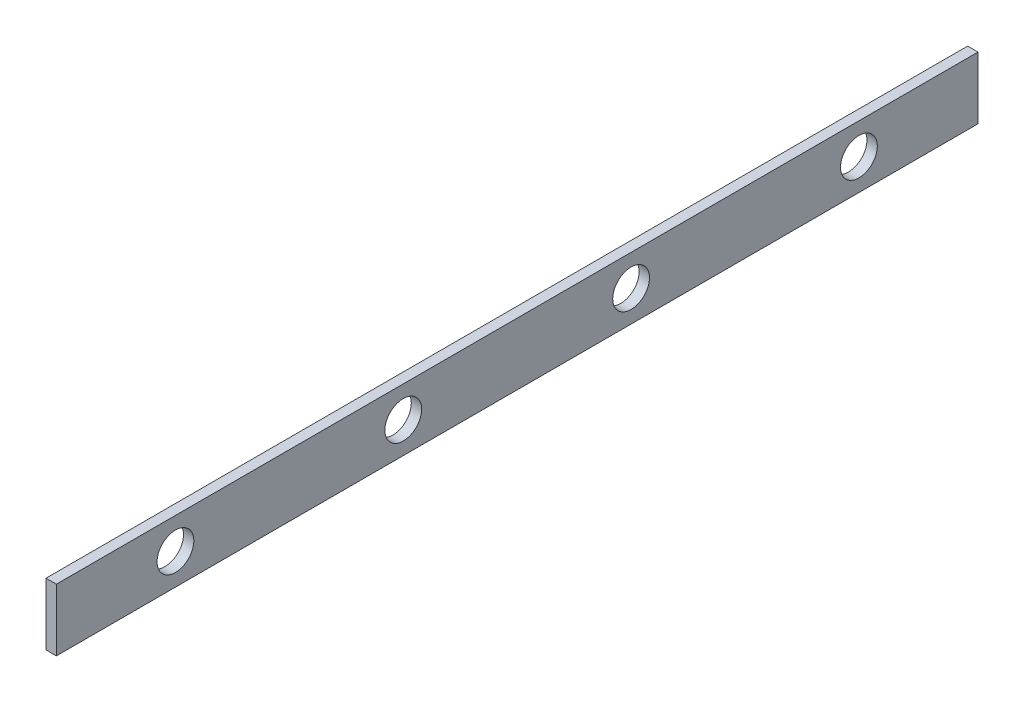
ISO-10303-21;
HEADER;
FILE_DESCRIPTION(('STEP AP214'),'2;1');
FILE_NAME('part.step','',(''),(''),'','','');
FILE_SCHEMA(('AUTOMOTIVE_DESIGN { 1 0 10303 214 1 1 1 1 }'));
ENDSEC;
DATA;
#1=APPLICATION_CONTEXT('core data for automotive mechanical design processes');
#2=APPLICATION_PROTOCOL_DEFINITION('international standard','automotive_design',2000,#1);
#3=PRODUCT_CONTEXT('',#1,'mechanical');
#4=PRODUCT('Part','Part','',(#3));
#5=PRODUCT_RELATED_PRODUCT_CATEGORY('part','',(#4));
#6=PRODUCT_DEFINITION_FORMATION('','',#4);
#7=PRODUCT_DEFINITION_CONTEXT('part definition',#1,'design');
#8=PRODUCT_DEFINITION('design','',#6,#7);
#9=PRODUCT_DEFINITION_SHAPE('','',#8);
#10=(LENGTH_UNIT() NAMED_UNIT(*) SI_UNIT(.MILLI.,.METRE.));
#11=(NAMED_UNIT(*) PLANE_ANGLE_UNIT() SI_UNIT($,.RADIAN.));
#12=(NAMED_UNIT(*) SI_UNIT($,.STERADIAN.) SOLID_ANGLE_UNIT());
#13=UNCERTAINTY_MEASURE_WITH_UNIT(LENGTH_MEASURE(1.E-05),#10,'distance_accuracy_value','');
#14=(GEOMETRIC_REPRESENTATION_CONTEXT(3) GLOBAL_UNCERTAINTY_ASSIGNED_CONTEXT((#13)) GLOBAL_UNIT_ASSIGNED_CONTEXT((#10,
#11,#12)) REPRESENTATION_CONTEXT('',''));
#15=CARTESIAN_POINT('',(0.,0.,0.));
#16=DIRECTION('',(0.,0.,1.));
#17=DIRECTION('',(1.,0.,0.));
#18=AXIS2_PLACEMENT_3D('',#15,#16,#17);
#19=CARTESIAN_POINT('',(600.,-60.0000000000011,-445.));
#20=DIRECTION('',(0.,0.999999999999999,0.));
#21=DIRECTION('',(0.,0.,0.999999999999999));
#22=AXIS2_PLACEMENT_3D('',#19,#20,#21);
#23=PLANE('',#22);
#24=DIRECTION('',(-1.,0.,0.));
#25=VECTOR('',#24,1.);
#26=CARTESIAN_POINT('',(600.000000000001,-60.0000000000008,445.));
#27=LINE('',#26,#25);
#28=CARTESIAN_POINT('',(610.000000000001,-60.0000000000009,445.));
#29=VERTEX_POINT('',#28);
#30=CARTESIAN_POINT('',(600.000000000001,-60.0000000000008,445.));
#31=VERTEX_POINT('',#30);
#32=EDGE_CURVE('E109',#29,#31,#27,.T.);
#33=ORIENTED_EDGE('',*,*,#32,.T.);
#34=DIRECTION('',(0.,0.,0.999999999999999));
#35=VECTOR('',#34,1.);
#36=CARTESIAN_POINT('',(600.,-60.0000000000011,-445.));
#37=LINE('',#36,#35);
#38=CARTESIAN_POINT('',(600.,-60.0000000000011,-445.));
#39=VERTEX_POINT('',#38);
#40=EDGE_CURVE('E11',#39,#31,#37,.T.);
#41=ORIENTED_EDGE('',*,*,#40,.F.);
#42=DIRECTION('',(-1.,0.,0.));
#43=VECTOR('',#42,1.);
#44=CARTESIAN_POINT('',(600.,-60.0000000000011,-445.));
#45=LINE('',#44,#43);
#46=CARTESIAN_POINT('',(610.000000000001,-60.0000000000011,-445.));
#47=VERTEX_POINT('',#46);
#48=EDGE_CURVE('E92',#47,#39,#45,.T.);
#49=ORIENTED_EDGE('',*,*,#48,.F.);
#50=DIRECTION('',(0.,0.,0.999999999999999));
#51=VECTOR('',#50,1.);
#52=CARTESIAN_POINT('',(610.000000000001,-60.0000000000011,-445.));
#53=LINE('',#52,#51);
#54=EDGE_CURVE('E105',#47,#29,#53,.T.);
#55=ORIENTED_EDGE('',*,*,#54,.T.);
#56=EDGE_LOOP('',(#33,#41,#49,#55));
#57=FACE_BOUND('',#56,.T.);
#58=ADVANCED_FACE('F40',(#57),#23,.F.);
#59=CARTESIAN_POINT('',(600.,-60.0000000000011,-445.));
#60=DIRECTION('',(1.,0.,0.));
#61=DIRECTION('',(0.,0.,-0.999999999999999));
#62=AXIS2_PLACEMENT_3D('',#59,#60,#61);
#63=PLANE('',#62);
#64=CARTESIAN_POINT('',(600.,-30.000000000014,329.999999999999));
#65=DIRECTION('',(1.,0.,0.));
#66=DIRECTION('',(0.,0.,-0.999999999999999));
#67=AXIS2_PLACEMENT_3D('',#64,#65,#66);
#68=CIRCLE('',#67,17.75);
#69=CARTESIAN_POINT('',(600.,-30.000000000014,312.249999999999));
#70=VERTEX_POINT('',#69);
#71=EDGE_CURVE('E155',#70,#70,#68,.T.);
#72=ORIENTED_EDGE('',*,*,#71,.T.);
#73=EDGE_LOOP('',(#72));
#74=FACE_BOUND('',#73,.T.);
#75=CARTESIAN_POINT('',(600.,-30.0000000000147,109.999999999999));
#76=DIRECTION('',(1.,0.,0.));
#77=DIRECTION('',(0.,0.,-0.999999999999999));
#78=AXIS2_PLACEMENT_3D('',#75,#76,#77);
#79=CIRCLE('',#78,17.75);
#80=CARTESIAN_POINT('',(600.,-30.0000000000147,92.2499999999993));
#81=VERTEX_POINT('',#80);
#82=EDGE_CURVE('E147',#81,#81,#79,.T.);
#83=ORIENTED_EDGE('',*,*,#82,.T.);
#84=EDGE_LOOP('',(#83));
#85=FACE_BOUND('',#84,.T.);
#86=CARTESIAN_POINT('',(600.,-30.0000000000146,-110.000000000001));
#87=DIRECTION('',(1.,0.,0.));
#88=DIRECTION('',(0.,0.,-0.999999999999999));
#89=AXIS2_PLACEMENT_3D('',#86,#87,#88);
#90=CIRCLE('',#89,17.75);
#91=CARTESIAN_POINT('',(600.,-30.0000000000146,-127.750000000001));
#92=VERTEX_POINT('',#91);
#93=EDGE_CURVE('E139',#92,#92,#90,.T.);
#94=ORIENTED_EDGE('',*,*,#93,.T.);
#95=EDGE_LOOP('',(#94));
#96=FACE_BOUND('',#95,.T.);
#97=CARTESIAN_POINT('',(600.,-30.0000000000141,-330.000000000001));
#98=DIRECTION('',(1.,0.,0.));
#99=DIRECTION('',(0.,0.,-0.999999999999999));
#100=AXIS2_PLACEMENT_3D('',#97,#98,#99);
#101=CIRCLE('',#100,17.75);
#102=CARTESIAN_POINT('',(600.,-30.0000000000141,-347.750000000001));
#103=VERTEX_POINT('',#102);
#104=EDGE_CURVE('E113',#103,#103,#101,.T.);
#105=ORIENTED_EDGE('',*,*,#104,.T.);
#106=EDGE_LOOP('',(#105));
#107=FACE_BOUND('',#106,.T.);
#108=DIRECTION('',(0.,0.999999999999999,0.));
#109=VECTOR('',#108,1.);
#110=CARTESIAN_POINT('',(600.000000000001,-60.0000000000008,445.));
#111=LINE('',#110,#109);
#112=CARTESIAN_POINT('',(600.000000000001,-5.55111512312578E-13,445.));
#113=VERTEX_POINT('',#112);
#114=EDGE_CURVE('E97',#31,#113,#111,.T.);
#115=ORIENTED_EDGE('',*,*,#114,.T.);
#116=DIRECTION('',(0.,0.,0.999999999999999));
#117=VECTOR('',#116,1.);
#118=CARTESIAN_POINT('',(600.000000000001,0.,-445.));
#119=LINE('',#118,#117);
#120=CARTESIAN_POINT('',(600.000000000001,0.,-445.));
#121=VERTEX_POINT('',#120);
#122=EDGE_CURVE('E49',#121,#113,#119,.T.);
#123=ORIENTED_EDGE('',*,*,#122,.F.);
#124=DIRECTION('',(0.,0.999999999999999,0.));
#125=VECTOR('',#124,1.);
#126=CARTESIAN_POINT('',(600.,-60.0000000000011,-445.));
#127=LINE('',#126,#125);
#128=EDGE_CURVE('E87',#39,#121,#127,.T.);
#129=ORIENTED_EDGE('',*,*,#128,.F.);
#130=ORIENTED_EDGE('',*,*,#40,.T.);
#131=EDGE_LOOP('',(#115,#123,#129,#130));
#132=FACE_BOUND('',#131,.T.);
#133=ADVANCED_FACE('F96',(#74,#85,#96,#107,#132),#63,.F.);
#134=CARTESIAN_POINT('',(610.000000000001,0.,-445.));
#135=DIRECTION('',(0.,-0.999999999999999,0.));
#136=DIRECTION('',(0.,0.,-0.999999999999999));
#137=AXIS2_PLACEMENT_3D('',#134,#135,#136);
#138=PLANE('',#137);
#139=DIRECTION('',(1.,0.,0.));
#140=VECTOR('',#139,1.);
#141=CARTESIAN_POINT('',(610.000000000001,-6.66133814775094E-13,445.));
#142=LINE('',#141,#140);
#143=CARTESIAN_POINT('',(610.000000000001,-6.66133814775094E-13,445.));
#144=VERTEX_POINT('',#143);
#145=EDGE_CURVE('E74',#113,#144,#142,.T.);
#146=ORIENTED_EDGE('',*,*,#145,.T.);
#147=DIRECTION('',(0.,0.,0.999999999999999));
#148=VECTOR('',#147,1.);
#149=CARTESIAN_POINT('',(610.000000000001,0.,-445.));
#150=LINE('',#149,#148);
#151=CARTESIAN_POINT('',(610.000000000001,0.,-445.));
#152=VERTEX_POINT('',#151);
#153=EDGE_CURVE('E99',#152,#144,#150,.T.);
#154=ORIENTED_EDGE('',*,*,#153,.F.);
#155=DIRECTION('',(1.,0.,0.));
#156=VECTOR('',#155,1.);
#157=CARTESIAN_POINT('',(610.000000000001,0.,-445.));
#158=LINE('',#157,#156);
#159=EDGE_CURVE('E90',#121,#152,#158,.T.);
#160=ORIENTED_EDGE('',*,*,#159,.F.);
#161=ORIENTED_EDGE('',*,*,#122,.T.);
#162=EDGE_LOOP('',(#146,#154,#160,#161));
#163=FACE_BOUND('',#162,.T.);
#164=ADVANCED_FACE('F100',(#163),#138,.F.);
#165=CARTESIAN_POINT('',(610.000000000001,-60.0000000000011,-445.));
#166=DIRECTION('',(-1.,0.,0.));
#167=DIRECTION('',(0.,0.,0.999999999999999));
#168=AXIS2_PLACEMENT_3D('',#165,#166,#167);
#169=PLANE('',#168);
#170=CARTESIAN_POINT('',(610.,-30.000000000014,330.));
#171=DIRECTION('',(-1.,0.,0.));
#172=DIRECTION('',(0.,0.,1.));
#173=AXIS2_PLACEMENT_3D('',#170,#171,#172);
#174=CIRCLE('',#173,17.75);
#175=CARTESIAN_POINT('',(610.,-30.000000000014,347.75));
#176=VERTEX_POINT('',#175);
#177=EDGE_CURVE('E159',#176,#176,#174,.T.);
#178=ORIENTED_EDGE('',*,*,#177,.T.);
#179=EDGE_LOOP('',(#178));
#180=FACE_BOUND('',#179,.T.);
#181=CARTESIAN_POINT('',(610.000000000001,-30.0000000000147,109.999999999999));
#182=DIRECTION('',(-1.,0.,0.));
#183=DIRECTION('',(0.,0.,1.));
#184=AXIS2_PLACEMENT_3D('',#181,#182,#183);
#185=CIRCLE('',#184,17.75);
#186=CARTESIAN_POINT('',(610.000000000001,-30.0000000000147,127.749999999999));
#187=VERTEX_POINT('',#186);
#188=EDGE_CURVE('E151',#187,#187,#185,.T.);
#189=ORIENTED_EDGE('',*,*,#188,.T.);
#190=EDGE_LOOP('',(#189));
#191=FACE_BOUND('',#190,.T.);
#192=CARTESIAN_POINT('',(610.,-30.0000000000146,-110.000000000001));
#193=DIRECTION('',(-1.,0.,0.));
#194=DIRECTION('',(0.,0.,1.));
#195=AXIS2_PLACEMENT_3D('',#192,#193,#194);
#196=CIRCLE('',#195,17.75);
#197=CARTESIAN_POINT('',(610.,-30.0000000000146,-92.2500000000007));
#198=VERTEX_POINT('',#197);
#199=EDGE_CURVE('E143',#198,#198,#196,.T.);
#200=ORIENTED_EDGE('',*,*,#199,.T.);
#201=EDGE_LOOP('',(#200));
#202=FACE_BOUND('',#201,.T.);
#203=CARTESIAN_POINT('',(610.,-30.0000000000146,-330.000000000001));
#204=DIRECTION('',(-1.,0.,0.));
#205=DIRECTION('',(0.,0.,1.));
#206=AXIS2_PLACEMENT_3D('',#203,#204,#205);
#207=CIRCLE('',#206,17.75);
#208=CARTESIAN_POINT('',(610.,-30.0000000000146,-312.250000000001));
#209=VERTEX_POINT('',#208);
#210=EDGE_CURVE('E135',#209,#209,#207,.T.);
#211=ORIENTED_EDGE('',*,*,#210,.T.);
#212=EDGE_LOOP('',(#211));
#213=FACE_BOUND('',#212,.T.);
#214=DIRECTION('',(0.,-0.999999999999999,0.));
#215=VECTOR('',#214,1.);
#216=CARTESIAN_POINT('',(610.000000000001,-60.0000000000009,445.));
#217=LINE('',#216,#215);
#218=EDGE_CURVE('E80',#144,#29,#217,.T.);
#219=ORIENTED_EDGE('',*,*,#218,.T.);
#220=ORIENTED_EDGE('',*,*,#54,.F.);
#221=DIRECTION('',(0.,-0.999999999999999,0.));
#222=VECTOR('',#221,1.);
#223=CARTESIAN_POINT('',(610.000000000001,-60.0000000000011,-445.));
#224=LINE('',#223,#222);
#225=EDGE_CURVE('E57',#152,#47,#224,.T.);
#226=ORIENTED_EDGE('',*,*,#225,.F.);
#227=ORIENTED_EDGE('',*,*,#153,.T.);
#228=EDGE_LOOP('',(#219,#220,#226,#227));
#229=FACE_BOUND('',#228,.T.);
#230=ADVANCED_FACE('F125',(#180,#191,#202,#213,#229),#169,.F.);
#231=CARTESIAN_POINT('',(1205.,-30.0000000000011,-445.));
#232=DIRECTION('',(0.,0.,0.999999999999999));
#233=DIRECTION('',(1.,0.,0.));
#234=AXIS2_PLACEMENT_3D('',#231,#232,#233);
#235=PLANE('',#234);
#236=ORIENTED_EDGE('',*,*,#48,.T.);
#237=ORIENTED_EDGE('',*,*,#128,.T.);
#238=ORIENTED_EDGE('',*,*,#159,.T.);
#239=ORIENTED_EDGE('',*,*,#225,.T.);
#240=EDGE_LOOP('',(#236,#237,#238,#239));
#241=FACE_BOUND('',#240,.T.);
#242=ADVANCED_FACE('F88',(#241),#235,.F.);
#243=CARTESIAN_POINT('',(1205.,-30.0000000000006,445.000000000001));
#244=DIRECTION('',(0.,0.,0.999999999999999));
#245=DIRECTION('',(1.,0.,0.));
#246=AXIS2_PLACEMENT_3D('',#243,#244,#245);
#247=PLANE('',#246);
#248=ORIENTED_EDGE('',*,*,#32,.F.);
#249=ORIENTED_EDGE('',*,*,#218,.F.);
#250=ORIENTED_EDGE('',*,*,#145,.F.);
#251=ORIENTED_EDGE('',*,*,#114,.F.);
#252=EDGE_LOOP('',(#248,#249,#250,#251));
#253=FACE_BOUND('',#252,.T.);
#254=ADVANCED_FACE('F128',(#253),#247,.T.);
#255=CARTESIAN_POINT('',(610.,-30.0000000000146,-330.000000000001));
#256=DIRECTION('',(-1.,0.,0.));
#257=DIRECTION('',(0.,0.,1.));
#258=AXIS2_PLACEMENT_3D('',#255,#256,#257);
#259=CYLINDRICAL_SURFACE('',#258,17.75);
#260=ORIENTED_EDGE('',*,*,#210,.F.);
#261=EDGE_LOOP('',(#260));
#262=FACE_BOUND('',#261,.T.);
#263=ORIENTED_EDGE('',*,*,#104,.F.);
#264=EDGE_LOOP('',(#263));
#265=FACE_BOUND('',#264,.T.);
#266=ADVANCED_FACE('F182',(#262,#265),#259,.F.);
#267=CARTESIAN_POINT('',(610.,-30.0000000000146,-110.000000000001));
#268=DIRECTION('',(-1.,0.,0.));
#269=DIRECTION('',(0.,0.,1.));
#270=AXIS2_PLACEMENT_3D('',#267,#268,#269);
#271=CYLINDRICAL_SURFACE('',#270,17.75);
#272=ORIENTED_EDGE('',*,*,#199,.F.);
#273=EDGE_LOOP('',(#272));
#274=FACE_BOUND('',#273,.T.);
#275=ORIENTED_EDGE('',*,*,#93,.F.);
#276=EDGE_LOOP('',(#275));
#277=FACE_BOUND('',#276,.T.);
#278=ADVANCED_FACE('F184',(#274,#277),#271,.F.);
#279=CARTESIAN_POINT('',(610.000000000001,-30.0000000000147,109.999999999999));
#280=DIRECTION('',(-1.,0.,0.));
#281=DIRECTION('',(0.,0.,1.));
#282=AXIS2_PLACEMENT_3D('',#279,#280,#281);
#283=CYLINDRICAL_SURFACE('',#282,17.75);
#284=ORIENTED_EDGE('',*,*,#188,.F.);
#285=EDGE_LOOP('',(#284));
#286=FACE_BOUND('',#285,.T.);
#287=ORIENTED_EDGE('',*,*,#82,.F.);
#288=EDGE_LOOP('',(#287));
#289=FACE_BOUND('',#288,.T.);
#290=ADVANCED_FACE('F170',(#286,#289),#283,.F.);
#291=CARTESIAN_POINT('',(610.,-30.000000000014,330.));
#292=DIRECTION('',(-1.,0.,0.));
#293=DIRECTION('',(0.,0.,1.));
#294=AXIS2_PLACEMENT_3D('',#291,#292,#293);
#295=CYLINDRICAL_SURFACE('',#294,17.75);
#296=ORIENTED_EDGE('',*,*,#177,.F.);
#297=EDGE_LOOP('',(#296));
#298=FACE_BOUND('',#297,.T.);
#299=ORIENTED_EDGE('',*,*,#71,.F.);
#300=EDGE_LOOP('',(#299));
#301=FACE_BOUND('',#300,.T.);
#302=ADVANCED_FACE('F167',(#298,#301),#295,.F.);
#303=CLOSED_SHELL('',(#58,#133,#164,#230,#242,#254,#266,#278,#290,#302));
#304=MANIFOLD_SOLID_BREP('B2',#303);
#305=ADVANCED_BREP_SHAPE_REPRESENTATION('',(#18,#304),#14);
#306=SHAPE_DEFINITION_REPRESENTATION(#9,#305);
ENDSEC;
END-ISO-10303-21;
